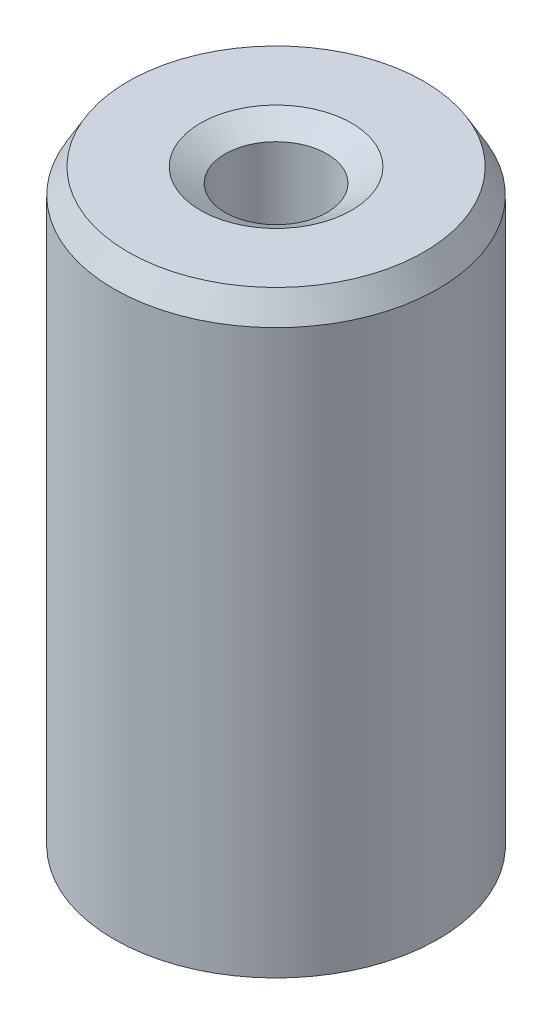
ISO-10303-21;
HEADER;
FILE_DESCRIPTION(('STEP AP214'),'2;1');
FILE_NAME('part.step','',(''),(''),'','','');
FILE_SCHEMA(('AUTOMOTIVE_DESIGN { 1 0 10303 214 1 1 1 1 }'));
ENDSEC;
DATA;
#1=APPLICATION_CONTEXT('core data for automotive mechanical design processes');
#2=APPLICATION_PROTOCOL_DEFINITION('international standard','automotive_design',2000,#1);
#3=PRODUCT_CONTEXT('',#1,'mechanical');
#4=PRODUCT('Part','Part','',(#3));
#5=PRODUCT_RELATED_PRODUCT_CATEGORY('part','',(#4));
#6=PRODUCT_DEFINITION_FORMATION('','',#4);
#7=PRODUCT_DEFINITION_CONTEXT('part definition',#1,'design');
#8=PRODUCT_DEFINITION('design','',#6,#7);
#9=PRODUCT_DEFINITION_SHAPE('','',#8);
#10=(LENGTH_UNIT() NAMED_UNIT(*) SI_UNIT(.MILLI.,.METRE.));
#11=(NAMED_UNIT(*) PLANE_ANGLE_UNIT() SI_UNIT($,.RADIAN.));
#12=(NAMED_UNIT(*) SI_UNIT($,.STERADIAN.) SOLID_ANGLE_UNIT());
#13=UNCERTAINTY_MEASURE_WITH_UNIT(LENGTH_MEASURE(1.E-05),#10,'distance_accuracy_value','');
#14=(GEOMETRIC_REPRESENTATION_CONTEXT(3) GLOBAL_UNCERTAINTY_ASSIGNED_CONTEXT((#13)) GLOBAL_UNIT_ASSIGNED_CONTEXT((#10,
#11,#12)) REPRESENTATION_CONTEXT('',''));
#15=CARTESIAN_POINT('',(0.,0.,0.));
#16=DIRECTION('',(0.,0.,1.));
#17=DIRECTION('',(1.,0.,0.));
#18=AXIS2_PLACEMENT_3D('',#15,#16,#17);
#19=CARTESIAN_POINT('',(0.,27.8512241652539,0.));
#20=DIRECTION('',(0.,-1.,0.));
#21=DIRECTION('',(0.,0.,-1.));
#22=AXIS2_PLACEMENT_3D('',#19,#20,#21);
#23=CYLINDRICAL_SURFACE('',#22,7.5);
#24=CARTESIAN_POINT('',(0.,0.66044802201326,0.));
#25=DIRECTION('',(0.,1.,0.));
#26=DIRECTION('',(0.,0.,1.));
#27=AXIS2_PLACEMENT_3D('',#24,#25,#26);
#28=CIRCLE('',#27,7.5);
#29=CARTESIAN_POINT('',(0.,0.66044802201326,7.5));
#30=VERTEX_POINT('',#29);
#31=EDGE_CURVE('E10',#30,#30,#28,.T.);
#32=ORIENTED_EDGE('',*,*,#31,.T.);
#33=EDGE_LOOP('',(#32));
#34=FACE_BOUND('',#33,.T.);
#35=CARTESIAN_POINT('',(0.,26.7072946353686,0.));
#36=DIRECTION('',(0.,1.,0.));
#37=DIRECTION('',(0.,0.,1.));
#38=AXIS2_PLACEMENT_3D('',#35,#36,#37);
#39=CIRCLE('',#38,7.5);
#40=CARTESIAN_POINT('',(0.,26.7072946353686,7.5));
#41=VERTEX_POINT('',#40);
#42=EDGE_CURVE('E50',#41,#41,#39,.F.);
#43=ORIENTED_EDGE('',*,*,#42,.T.);
#44=EDGE_LOOP('',(#43));
#45=FACE_BOUND('',#44,.T.);
#46=ADVANCED_FACE('F39',(#34,#45),#23,.T.);
#47=CARTESIAN_POINT('',(0.,27.8512241652539,0.));
#48=DIRECTION('',(0.,1.,0.));
#49=DIRECTION('',(0.,0.,1.));
#50=AXIS2_PLACEMENT_3D('',#47,#48,#49);
#51=PLANE('',#50);
#52=CARTESIAN_POINT('',(0.,27.8512241652539,0.));
#53=DIRECTION('',(0.,1.,0.));
#54=DIRECTION('',(0.,0.,1.));
#55=AXIS2_PLACEMENT_3D('',#52,#53,#54);
#56=CIRCLE('',#55,3.49624404508175);
#57=CARTESIAN_POINT('',(0.,27.8512241652539,3.49624404508175));
#58=VERTEX_POINT('',#57);
#59=EDGE_CURVE('E58',#58,#58,#56,.F.);
#60=ORIENTED_EDGE('',*,*,#59,.T.);
#61=EDGE_LOOP('',(#60));
#62=FACE_BOUND('',#61,.T.);
#63=CARTESIAN_POINT('',(0.,27.8512241652539,0.));
#64=DIRECTION('',(0.,1.,0.));
#65=DIRECTION('',(0.,0.,1.));
#66=AXIS2_PLACEMENT_3D('',#63,#64,#65);
#67=CIRCLE('',#66,6.83955197798674);
#68=CARTESIAN_POINT('',(0.,27.8512241652539,6.83955197798674));
#69=VERTEX_POINT('',#68);
#70=EDGE_CURVE('E61',#69,#69,#67,.T.);
#71=ORIENTED_EDGE('',*,*,#70,.T.);
#72=EDGE_LOOP('',(#71));
#73=FACE_BOUND('',#72,.T.);
#74=ADVANCED_FACE('F88',(#62,#73),#51,.T.);
#75=CARTESIAN_POINT('',(0.,0.,0.));
#76=DIRECTION('',(0.,1.,0.));
#77=DIRECTION('',(0.,0.,1.));
#78=AXIS2_PLACEMENT_3D('',#75,#76,#77);
#79=PLANE('',#78);
#80=CARTESIAN_POINT('',(0.,0.,0.));
#81=DIRECTION('',(0.,1.,0.));
#82=DIRECTION('',(0.,0.,1.));
#83=AXIS2_PLACEMENT_3D('',#80,#81,#82);
#84=CIRCLE('',#83,3.01276253720967);
#85=CARTESIAN_POINT('',(0.,0.,3.01276253720967));
#86=VERTEX_POINT('',#85);
#87=EDGE_CURVE('E51',#86,#86,#84,.T.);
#88=ORIENTED_EDGE('',*,*,#87,.T.);
#89=EDGE_LOOP('',(#88));
#90=FACE_BOUND('',#89,.T.);
#91=CARTESIAN_POINT('',(0.,0.,0.));
#92=DIRECTION('',(0.,1.,0.));
#93=DIRECTION('',(0.,0.,1.));
#94=AXIS2_PLACEMENT_3D('',#91,#92,#93);
#95=CIRCLE('',#94,6.35607047011466);
#96=CARTESIAN_POINT('',(0.,0.,6.35607047011466));
#97=VERTEX_POINT('',#96);
#98=EDGE_CURVE('E54',#97,#97,#95,.F.);
#99=ORIENTED_EDGE('',*,*,#98,.T.);
#100=EDGE_LOOP('',(#99));
#101=FACE_BOUND('',#100,.T.);
#102=ADVANCED_FACE('F83',(#90,#101),#79,.F.);
#103=CARTESIAN_POINT('',(0.,27.8512241652539,0.));
#104=DIRECTION('',(0.,-1.,0.));
#105=DIRECTION('',(0.,0.,-1.));
#106=AXIS2_PLACEMENT_3D('',#103,#104,#105);
#107=CYLINDRICAL_SURFACE('',#106,2.35231451519641);
#108=CARTESIAN_POINT('',(0.,27.1907761432407,0.));
#109=DIRECTION('',(0.,1.,0.));
#110=DIRECTION('',(0.,0.,1.));
#111=AXIS2_PLACEMENT_3D('',#108,#109,#110);
#112=CIRCLE('',#111,2.35231451519641);
#113=CARTESIAN_POINT('',(0.,27.1907761432407,2.35231451519641));
#114=VERTEX_POINT('',#113);
#115=EDGE_CURVE('E67',#114,#114,#112,.T.);
#116=ORIENTED_EDGE('',*,*,#115,.T.);
#117=EDGE_LOOP('',(#116));
#118=FACE_BOUND('',#117,.T.);
#119=CARTESIAN_POINT('',(0.,1.14392952988535,0.));
#120=DIRECTION('',(0.,1.,0.));
#121=DIRECTION('',(0.,0.,1.));
#122=AXIS2_PLACEMENT_3D('',#119,#120,#121);
#123=CIRCLE('',#122,2.35231451519641);
#124=CARTESIAN_POINT('',(0.,1.14392952988535,2.35231451519641));
#125=VERTEX_POINT('',#124);
#126=EDGE_CURVE('E69',#125,#125,#123,.F.);
#127=ORIENTED_EDGE('',*,*,#126,.T.);
#128=EDGE_LOOP('',(#127));
#129=FACE_BOUND('',#128,.T.);
#130=ADVANCED_FACE('F71',(#118,#129),#107,.F.);
#131=CARTESIAN_POINT('',(0.,27.1907761432407,0.));
#132=DIRECTION('',(0.,1.,0.));
#133=DIRECTION('',(0.,0.,1.));
#134=AXIS2_PLACEMENT_3D('',#131,#132,#133);
#135=CONICAL_SURFACE('',#134,2.35231451519641,1.0471975511966);
#136=ORIENTED_EDGE('',*,*,#59,.F.);
#137=EDGE_LOOP('',(#136));
#138=FACE_BOUND('',#137,.T.);
#139=ORIENTED_EDGE('',*,*,#115,.F.);
#140=EDGE_LOOP('',(#139));
#141=FACE_BOUND('',#140,.T.);
#142=ADVANCED_FACE('F77',(#138,#141),#135,.F.);
#143=CARTESIAN_POINT('',(0.,0.,0.));
#144=DIRECTION('',(0.,-1.,0.));
#145=DIRECTION('',(0.,0.,-1.));
#146=AXIS2_PLACEMENT_3D('',#143,#144,#145);
#147=CONICAL_SURFACE('',#146,3.01276253720967,0.523598775598297);
#148=ORIENTED_EDGE('',*,*,#126,.F.);
#149=EDGE_LOOP('',(#148));
#150=FACE_BOUND('',#149,.T.);
#151=ORIENTED_EDGE('',*,*,#87,.F.);
#152=EDGE_LOOP('',(#151));
#153=FACE_BOUND('',#152,.T.);
#154=ADVANCED_FACE('F73',(#150,#153),#147,.F.);
#155=CARTESIAN_POINT('',(0.,0.66044802201326,0.));
#156=DIRECTION('',(0.,1.,0.));
#157=DIRECTION('',(0.,0.,1.));
#158=AXIS2_PLACEMENT_3D('',#155,#156,#157);
#159=CONICAL_SURFACE('',#158,7.5,1.0471975511966);
#160=ORIENTED_EDGE('',*,*,#98,.F.);
#161=EDGE_LOOP('',(#160));
#162=FACE_BOUND('',#161,.T.);
#163=ORIENTED_EDGE('',*,*,#31,.F.);
#164=EDGE_LOOP('',(#163));
#165=FACE_BOUND('',#164,.T.);
#166=ADVANCED_FACE('F76',(#162,#165),#159,.T.);
#167=CARTESIAN_POINT('',(0.,27.8512241652539,0.));
#168=DIRECTION('',(0.,-1.,0.));
#169=DIRECTION('',(0.,0.,-1.));
#170=AXIS2_PLACEMENT_3D('',#167,#168,#169);
#171=CONICAL_SURFACE('',#170,6.83955197798674,0.523598775598292);
#172=ORIENTED_EDGE('',*,*,#42,.F.);
#173=EDGE_LOOP('',(#172));
#174=FACE_BOUND('',#173,.T.);
#175=ORIENTED_EDGE('',*,*,#70,.F.);
#176=EDGE_LOOP('',(#175));
#177=FACE_BOUND('',#176,.T.);
#178=ADVANCED_FACE('F45',(#174,#177),#171,.T.);
#179=CLOSED_SHELL('',(#46,#74,#102,#130,#142,#154,#166,#178));
#180=MANIFOLD_SOLID_BREP('B2',#179);
#181=ADVANCED_BREP_SHAPE_REPRESENTATION('',(#18,#180),#14);
#182=SHAPE_DEFINITION_REPRESENTATION(#9,#181);
ENDSEC;
END-ISO-10303-21;
